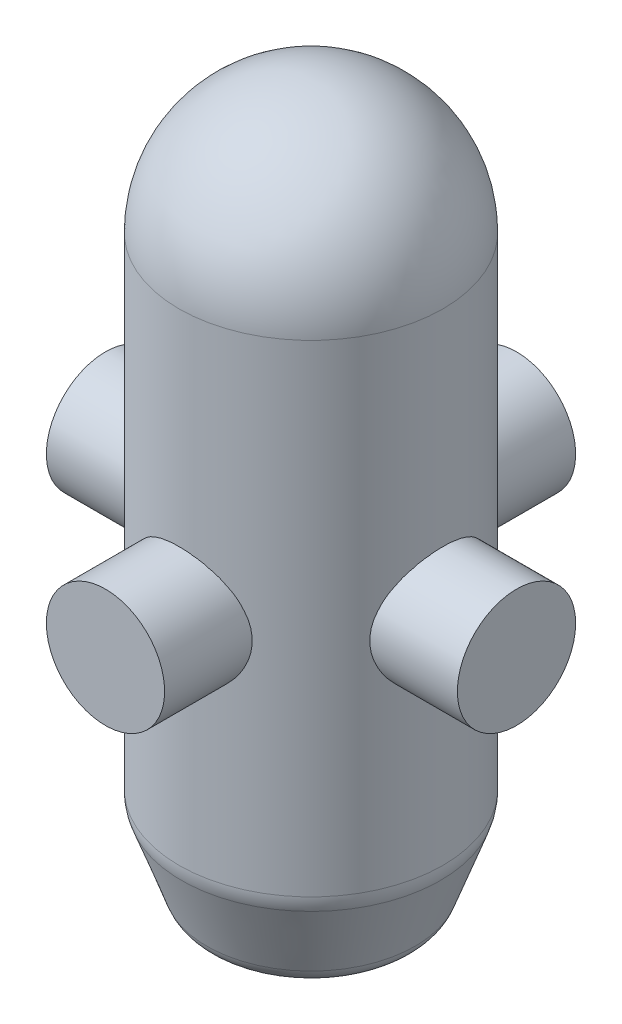
ISO-10303-21;
HEADER;
FILE_DESCRIPTION(('STEP AP214'),'2;1');
FILE_NAME('part.step','',(''),(''),'','','');
FILE_SCHEMA(('AUTOMOTIVE_DESIGN { 1 0 10303 214 1 1 1 1 }'));
ENDSEC;
DATA;
#1=APPLICATION_CONTEXT('core data for automotive mechanical design processes');
#2=APPLICATION_PROTOCOL_DEFINITION('international standard','automotive_design',2000,#1);
#3=PRODUCT_CONTEXT('',#1,'mechanical');
#4=PRODUCT('Part','Part','',(#3));
#5=PRODUCT_RELATED_PRODUCT_CATEGORY('part','',(#4));
#6=PRODUCT_DEFINITION_FORMATION('','',#4);
#7=PRODUCT_DEFINITION_CONTEXT('part definition',#1,'design');
#8=PRODUCT_DEFINITION('design','',#6,#7);
#9=PRODUCT_DEFINITION_SHAPE('','',#8);
#10=(LENGTH_UNIT() NAMED_UNIT(*) SI_UNIT(.MILLI.,.METRE.));
#11=(NAMED_UNIT(*) PLANE_ANGLE_UNIT() SI_UNIT($,.RADIAN.));
#12=(NAMED_UNIT(*) SI_UNIT($,.STERADIAN.) SOLID_ANGLE_UNIT());
#13=UNCERTAINTY_MEASURE_WITH_UNIT(LENGTH_MEASURE(1.E-05),#10,'distance_accuracy_value','');
#14=(GEOMETRIC_REPRESENTATION_CONTEXT(3) GLOBAL_UNCERTAINTY_ASSIGNED_CONTEXT((#13)) GLOBAL_UNIT_ASSIGNED_CONTEXT((#10,
#11,#12)) REPRESENTATION_CONTEXT('',''));
#15=CARTESIAN_POINT('',(0.,0.,0.));
#16=DIRECTION('',(0.,0.,1.));
#17=DIRECTION('',(1.,0.,0.));
#18=AXIS2_PLACEMENT_3D('',#15,#16,#17);
#19=CARTESIAN_POINT('',(-3.41641449005801E-13,-126.2,-97.85));
#20=DIRECTION('',(0.,0.,1.));
#21=DIRECTION('',(1.,0.,0.));
#22=AXIS2_PLACEMENT_3D('',#19,#20,#21);
#23=CYLINDRICAL_SURFACE('',#22,28.15);
#24=CARTESIAN_POINT('',(-3.41641449005801E-13,-126.2,-97.85));
#25=DIRECTION('',(0.,0.,-1.));
#26=DIRECTION('',(-1.,0.,0.));
#27=AXIS2_PLACEMENT_3D('',#24,#25,#26);
#28=CIRCLE('',#27,28.15);
#29=CARTESIAN_POINT('',(-28.1500000000003,-126.2,-97.8499999999999));
#30=VERTEX_POINT('',#29);
#31=EDGE_CURVE('E11',#30,#30,#28,.T.);
#32=ORIENTED_EDGE('',*,*,#31,.F.);
#33=EDGE_LOOP('',(#32));
#34=FACE_BOUND('',#33,.T.);
#35=CARTESIAN_POINT('',(3.41641449005801E-13,-126.2,97.85));
#36=DIRECTION('',(0.,0.,-1.));
#37=DIRECTION('',(-1.,0.,0.));
#38=AXIS2_PLACEMENT_3D('',#35,#36,#37);
#39=CIRCLE('',#38,28.15);
#40=CARTESIAN_POINT('',(-28.1499999999997,-126.2,97.8500000000001));
#41=VERTEX_POINT('',#40);
#42=EDGE_CURVE('E54',#41,#41,#39,.T.);
#43=ORIENTED_EDGE('',*,*,#42,.T.);
#44=EDGE_LOOP('',(#43));
#45=FACE_BOUND('',#44,.T.);
#46=ADVANCED_FACE('F51',(#34,#45),#23,.T.);
#47=CARTESIAN_POINT('',(-3.41641449005801E-13,-126.2,-97.85));
#48=DIRECTION('',(0.,0.,-1.));
#49=DIRECTION('',(-1.,0.,0.));
#50=AXIS2_PLACEMENT_3D('',#47,#48,#49);
#51=PLANE('',#50);
#52=ORIENTED_EDGE('',*,*,#31,.T.);
#53=EDGE_LOOP('',(#52));
#54=FACE_BOUND('',#53,.T.);
#55=ADVANCED_FACE('F66',(#54),#51,.T.);
#56=CARTESIAN_POINT('',(3.41641449005801E-13,-126.2,97.85));
#57=DIRECTION('',(0.,0.,-1.));
#58=DIRECTION('',(-1.,0.,0.));
#59=AXIS2_PLACEMENT_3D('',#56,#57,#58);
#60=PLANE('',#59);
#61=ORIENTED_EDGE('',*,*,#42,.F.);
#62=EDGE_LOOP('',(#61));
#63=FACE_BOUND('',#62,.T.);
#64=ADVANCED_FACE('F64',(#63),#60,.F.);
#65=CLOSED_SHELL('',(#46,#55,#64));
#66=MANIFOLD_SOLID_BREP('B2',#65);
#67=CARTESIAN_POINT('',(97.85,-126.2,0.));
#68=DIRECTION('',(-1.,0.,0.));
#69=DIRECTION('',(0.,0.,1.));
#70=AXIS2_PLACEMENT_3D('',#67,#68,#69);
#71=CYLINDRICAL_SURFACE('',#70,28.15);
#72=CARTESIAN_POINT('',(97.85,-126.2,0.));
#73=DIRECTION('',(1.,0.,0.));
#74=DIRECTION('',(0.,0.,-1.));
#75=AXIS2_PLACEMENT_3D('',#72,#73,#74);
#76=CIRCLE('',#75,28.15);
#77=CARTESIAN_POINT('',(97.85,-126.2,-28.15));
#78=VERTEX_POINT('',#77);
#79=EDGE_CURVE('E50',#78,#78,#76,.T.);
#80=ORIENTED_EDGE('',*,*,#79,.F.);
#81=EDGE_LOOP('',(#80));
#82=FACE_BOUND('',#81,.T.);
#83=CARTESIAN_POINT('',(-97.85,-126.2,0.));
#84=DIRECTION('',(1.,0.,0.));
#85=DIRECTION('',(0.,0.,-1.));
#86=AXIS2_PLACEMENT_3D('',#83,#84,#85);
#87=CIRCLE('',#86,28.15);
#88=CARTESIAN_POINT('',(-97.85,-126.2,-28.15));
#89=VERTEX_POINT('',#88);
#90=EDGE_CURVE('E103',#89,#89,#87,.T.);
#91=ORIENTED_EDGE('',*,*,#90,.T.);
#92=EDGE_LOOP('',(#91));
#93=FACE_BOUND('',#92,.T.);
#94=ADVANCED_FACE('F100',(#82,#93),#71,.T.);
#95=CARTESIAN_POINT('',(97.85,-126.2,0.));
#96=DIRECTION('',(1.,0.,0.));
#97=DIRECTION('',(0.,0.,-1.));
#98=AXIS2_PLACEMENT_3D('',#95,#96,#97);
#99=PLANE('',#98);
#100=ORIENTED_EDGE('',*,*,#79,.T.);
#101=EDGE_LOOP('',(#100));
#102=FACE_BOUND('',#101,.T.);
#103=ADVANCED_FACE('F115',(#102),#99,.T.);
#104=CARTESIAN_POINT('',(-97.85,-126.2,0.));
#105=DIRECTION('',(1.,0.,0.));
#106=DIRECTION('',(0.,0.,-1.));
#107=AXIS2_PLACEMENT_3D('',#104,#105,#106);
#108=PLANE('',#107);
#109=ORIENTED_EDGE('',*,*,#90,.F.);
#110=EDGE_LOOP('',(#109));
#111=FACE_BOUND('',#110,.T.);
#112=ADVANCED_FACE('F113',(#111),#108,.F.);
#113=CLOSED_SHELL('',(#94,#103,#112));
#114=MANIFOLD_SOLID_BREP('B6',#113);
#115=CARTESIAN_POINT('',(0.,-278.,0.));
#116=DIRECTION('',(0.,-1.,0.));
#117=DIRECTION('',(0.,0.,-1.));
#118=AXIS2_PLACEMENT_3D('',#115,#116,#117);
#119=CYLINDRICAL_SURFACE('',#118,62.866205);
#120=CARTESIAN_POINT('',(0.,-229.473460385831,0.));
#121=DIRECTION('',(0.,1.,0.));
#122=DIRECTION('',(0.,0.,1.));
#123=AXIS2_PLACEMENT_3D('',#120,#121,#122);
#124=CIRCLE('',#123,62.866205);
#125=CARTESIAN_POINT('',(0.,-229.473460385831,62.866205));
#126=VERTEX_POINT('',#125);
#127=EDGE_CURVE('E155',#126,#126,#124,.T.);
#128=ORIENTED_EDGE('',*,*,#127,.T.);
#129=EDGE_LOOP('',(#128));
#130=FACE_BOUND('',#129,.T.);
#131=CARTESIAN_POINT('',(0.,0.,0.));
#132=DIRECTION('',(0.,-1.,0.));
#133=DIRECTION('',(0.,0.,-1.));
#134=AXIS2_PLACEMENT_3D('',#131,#132,#133);
#135=CIRCLE('',#134,62.866205);
#136=CARTESIAN_POINT('',(0.,0.,-62.866205));
#137=VERTEX_POINT('',#136);
#138=EDGE_CURVE('E182',#137,#137,#135,.T.);
#139=ORIENTED_EDGE('',*,*,#138,.T.);
#140=EDGE_LOOP('',(#139));
#141=FACE_BOUND('',#140,.T.);
#142=ADVANCED_FACE('F143',(#130,#141),#119,.T.);
#143=CARTESIAN_POINT('',(0.,-278.,0.));
#144=DIRECTION('',(0.,1.,0.));
#145=DIRECTION('',(0.,0.,1.));
#146=AXIS2_PLACEMENT_3D('',#143,#144,#145);
#147=CONICAL_SURFACE('',#146,46.4875444580209,0.349065850398866);
#148=CARTESIAN_POINT('',(0.,-269.446261863234,0.));
#149=DIRECTION('',(0.,-1.,0.));
#150=DIRECTION('',(0.,0.,-1.));
#151=AXIS2_PLACEMENT_3D('',#148,#149,#150);
#152=CIRCLE('',#151,49.6008505315115);
#153=CARTESIAN_POINT('',(0.,-269.446261863234,-49.6008505315115));
#154=VERTEX_POINT('',#153);
#155=EDGE_CURVE('E99',#154,#154,#152,.F.);
#156=ORIENTED_EDGE('',*,*,#155,.T.);
#157=EDGE_LOOP('',(#156));
#158=FACE_BOUND('',#157,.T.);
#159=CARTESIAN_POINT('',(0.,-236.313863252344,0.));
#160=DIRECTION('',(0.,-1.,0.));
#161=DIRECTION('',(0.,0.,-1.));
#162=AXIS2_PLACEMENT_3D('',#159,#160,#161);
#163=CIRCLE('',#162,61.6600574157182);
#164=CARTESIAN_POINT('',(0.,-236.313863252344,-61.6600574157182));
#165=VERTEX_POINT('',#164);
#166=EDGE_CURVE('E159',#165,#165,#163,.T.);
#167=ORIENTED_EDGE('',*,*,#166,.T.);
#168=EDGE_LOOP('',(#167));
#169=FACE_BOUND('',#168,.T.);
#170=ADVANCED_FACE('F199',(#158,#169),#147,.T.);
#171=CARTESIAN_POINT('',(46.4875444580209,-278.,0.));
#172=DIRECTION('',(0.,-1.,0.));
#173=DIRECTION('',(0.,0.,-1.));
#174=AXIS2_PLACEMENT_3D('',#171,#172,#173);
#175=PLANE('',#174);
#176=CARTESIAN_POINT('',(0.,-278.,0.));
#177=DIRECTION('',(0.,-1.,0.));
#178=DIRECTION('',(0.,0.,-1.));
#179=AXIS2_PLACEMENT_3D('',#176,#177,#178);
#180=CIRCLE('',#179,37.3848464612947);
#181=CARTESIAN_POINT('',(0.,-278.,-37.3848464612947));
#182=VERTEX_POINT('',#181);
#183=EDGE_CURVE('E151',#182,#182,#180,.T.);
#184=ORIENTED_EDGE('',*,*,#183,.T.);
#185=EDGE_LOOP('',(#184));
#186=FACE_BOUND('',#185,.T.);
#187=ADVANCED_FACE('F205',(#186),#175,.T.);
#188=CARTESIAN_POINT('',(0.,-229.473460385831,0.));
#189=DIRECTION('',(0.,1.,0.));
#190=DIRECTION('',(0.,0.,1.));
#191=AXIS2_PLACEMENT_3D('',#188,#189,#190);
#192=TOROIDAL_SURFACE('',#191,42.866205,20.);
#193=ORIENTED_EDGE('',*,*,#127,.F.);
#194=EDGE_LOOP('',(#193));
#195=FACE_BOUND('',#194,.T.);
#196=ORIENTED_EDGE('',*,*,#166,.F.);
#197=EDGE_LOOP('',(#196));
#198=FACE_BOUND('',#197,.T.);
#199=ADVANCED_FACE('F194',(#195,#198),#192,.T.);
#200=CARTESIAN_POINT('',(0.,-265.,0.));
#201=DIRECTION('',(0.,-1.,0.));
#202=DIRECTION('',(0.,0.,-1.));
#203=AXIS2_PLACEMENT_3D('',#200,#201,#202);
#204=TOROIDAL_SURFACE('',#203,37.3848464612947,13.);
#205=ORIENTED_EDGE('',*,*,#155,.F.);
#206=EDGE_LOOP('',(#205));
#207=FACE_BOUND('',#206,.T.);
#208=ORIENTED_EDGE('',*,*,#183,.F.);
#209=EDGE_LOOP('',(#208));
#210=FACE_BOUND('',#209,.T.);
#211=ADVANCED_FACE('F145',(#207,#210),#204,.T.);
#212=CARTESIAN_POINT('',(0.,0.,0.));
#213=DIRECTION('',(0.,-1.,0.));
#214=DIRECTION('',(0.,0.,-1.));
#215=AXIS2_PLACEMENT_3D('',#212,#213,#214);
#216=SPHERICAL_SURFACE('',#215,62.866205);
#217=ORIENTED_EDGE('',*,*,#138,.F.);
#218=EDGE_LOOP('',(#217));
#219=FACE_BOUND('',#218,.T.);
#220=ADVANCED_FACE('F187',(#219),#216,.T.);
#221=CLOSED_SHELL('',(#142,#170,#187,#199,#211,#220));
#222=CARTESIAN_POINT('',(0.,0.,62.866205));
#223=DIRECTION('',(0.,1.,0.));
#224=DIRECTION('',(0.,0.,1.));
#225=AXIS2_PLACEMENT_3D('',#222,#223,#224);
#226=PLANE('',#225);
#227=CARTESIAN_POINT('',(0.,0.,0.));
#228=DIRECTION('',(0.,1.,0.));
#229=DIRECTION('',(0.,0.,1.));
#230=AXIS2_PLACEMENT_3D('',#227,#228,#229);
#231=CIRCLE('',#230,57.866205);
#232=CARTESIAN_POINT('',(0.,0.,57.866205));
#233=VERTEX_POINT('',#232);
#234=EDGE_CURVE('E165',#233,#233,#231,.F.);
#235=ORIENTED_EDGE('',*,*,#234,.T.);
#236=EDGE_LOOP('',(#235));
#237=FACE_BOUND('',#236,.T.);
#238=ADVANCED_FACE('F234',(#237),#226,.F.);
#239=CARTESIAN_POINT('',(46.4875444580209,-273.,0.));
#240=DIRECTION('',(0.,-1.,0.));
#241=DIRECTION('',(0.,0.,-1.));
#242=AXIS2_PLACEMENT_3D('',#239,#240,#241);
#243=PLANE('',#242);
#244=CARTESIAN_POINT('',(0.,-273.,0.));
#245=DIRECTION('',(0.,-1.,0.));
#246=DIRECTION('',(0.,0.,-1.));
#247=AXIS2_PLACEMENT_3D('',#244,#245,#246);
#248=CIRCLE('',#247,37.3848464612947);
#249=CARTESIAN_POINT('',(0.,-273.,-37.3848464612947));
#250=VERTEX_POINT('',#249);
#251=EDGE_CURVE('E170',#250,#250,#248,.T.);
#252=ORIENTED_EDGE('',*,*,#251,.F.);
#253=EDGE_LOOP('',(#252));
#254=FACE_BOUND('',#253,.T.);
#255=ADVANCED_FACE('F224',(#254),#243,.F.);
#256=CARTESIAN_POINT('',(0.,-265.,0.));
#257=DIRECTION('',(0.,-1.,0.));
#258=DIRECTION('',(0.,0.,-1.));
#259=AXIS2_PLACEMENT_3D('',#256,#257,#258);
#260=TOROIDAL_SURFACE('',#259,37.3848464612947,8.);
#261=CARTESIAN_POINT('',(0.,-267.736161146605,0.));
#262=DIRECTION('',(0.,1.,0.));
#263=DIRECTION('',(0.,0.,1.));
#264=AXIS2_PLACEMENT_3D('',#261,#262,#263);
#265=CIRCLE('',#264,44.9023874275819);
#266=CARTESIAN_POINT('',(0.,-267.736161146605,44.9023874275819));
#267=VERTEX_POINT('',#266);
#268=EDGE_CURVE('E164',#267,#267,#265,.T.);
#269=ORIENTED_EDGE('',*,*,#268,.T.);
#270=EDGE_LOOP('',(#269));
#271=FACE_BOUND('',#270,.T.);
#272=ORIENTED_EDGE('',*,*,#251,.T.);
#273=EDGE_LOOP('',(#272));
#274=FACE_BOUND('',#273,.T.);
#275=ADVANCED_FACE('F220',(#271,#274),#260,.F.);
#276=CARTESIAN_POINT('',(0.,-276.289899283372,0.));
#277=DIRECTION('',(0.,1.,0.));
#278=DIRECTION('',(0.,0.,1.));
#279=AXIS2_PLACEMENT_3D('',#276,#277,#278);
#280=CONICAL_SURFACE('',#279,41.7890813540914,0.349065850398866);
#281=ORIENTED_EDGE('',*,*,#268,.F.);
#282=EDGE_LOOP('',(#281));
#283=FACE_BOUND('',#282,.T.);
#284=CARTESIAN_POINT('',(0.,-234.603762535716,0.));
#285=DIRECTION('',(0.,1.,0.));
#286=DIRECTION('',(0.,0.,1.));
#287=AXIS2_PLACEMENT_3D('',#284,#285,#286);
#288=CIRCLE('',#287,56.9615943117886);
#289=CARTESIAN_POINT('',(0.,-234.603762535716,56.9615943117886));
#290=VERTEX_POINT('',#289);
#291=EDGE_CURVE('E168',#290,#290,#288,.F.);
#292=ORIENTED_EDGE('',*,*,#291,.F.);
#293=EDGE_LOOP('',(#292));
#294=FACE_BOUND('',#293,.T.);
#295=ADVANCED_FACE('F223',(#283,#294),#280,.F.);
#296=CARTESIAN_POINT('',(0.,-229.473460385831,0.));
#297=DIRECTION('',(0.,1.,0.));
#298=DIRECTION('',(0.,0.,1.));
#299=AXIS2_PLACEMENT_3D('',#296,#297,#298);
#300=TOROIDAL_SURFACE('',#299,42.866205,15.);
#301=CARTESIAN_POINT('',(0.,-229.473460385831,0.));
#302=DIRECTION('',(0.,-1.,0.));
#303=DIRECTION('',(0.,0.,-1.));
#304=AXIS2_PLACEMENT_3D('',#301,#302,#303);
#305=CIRCLE('',#304,57.866205);
#306=CARTESIAN_POINT('',(0.,-229.473460385831,-57.866205));
#307=VERTEX_POINT('',#306);
#308=EDGE_CURVE('E173',#307,#307,#305,.F.);
#309=ORIENTED_EDGE('',*,*,#308,.T.);
#310=EDGE_LOOP('',(#309));
#311=FACE_BOUND('',#310,.T.);
#312=ORIENTED_EDGE('',*,*,#291,.T.);
#313=EDGE_LOOP('',(#312));
#314=FACE_BOUND('',#313,.T.);
#315=ADVANCED_FACE('F227',(#311,#314),#300,.F.);
#316=CARTESIAN_POINT('',(0.,-278.,0.));
#317=DIRECTION('',(0.,-1.,0.));
#318=DIRECTION('',(0.,0.,-1.));
#319=AXIS2_PLACEMENT_3D('',#316,#317,#318);
#320=CYLINDRICAL_SURFACE('',#319,57.866205);
#321=ORIENTED_EDGE('',*,*,#308,.F.);
#322=EDGE_LOOP('',(#321));
#323=FACE_BOUND('',#322,.T.);
#324=ORIENTED_EDGE('',*,*,#234,.F.);
#325=EDGE_LOOP('',(#324));
#326=FACE_BOUND('',#325,.T.);
#327=ADVANCED_FACE('F230',(#323,#326),#320,.F.);
#328=CLOSED_SHELL('',(#238,#255,#275,#295,#315,#327));
#329=CARTESIAN_POINT('',(0.,0.,0.));
#330=DIRECTION('',(0.,-1.,0.));
#331=DIRECTION('',(0.,0.,-1.));
#332=AXIS2_PLACEMENT_3D('',#329,#330,#331);
#333=SPHERICAL_SURFACE('',#332,57.866205);
#334=CARTESIAN_POINT('',(0.,5.,0.));
#335=DIRECTION('',(0.,1.,0.));
#336=DIRECTION('',(0.,0.,1.));
#337=AXIS2_PLACEMENT_3D('',#334,#335,#336);
#338=CIRCLE('',#337,57.6497847446287);
#339=CARTESIAN_POINT('',(0.,5.,57.6497847446287));
#340=VERTEX_POINT('',#339);
#341=EDGE_CURVE('E169',#340,#340,#338,.F.);
#342=ORIENTED_EDGE('',*,*,#341,.T.);
#343=EDGE_LOOP('',(#342));
#344=FACE_BOUND('',#343,.T.);
#345=ADVANCED_FACE('F244',(#344),#333,.F.);
#346=CARTESIAN_POINT('',(0.,5.,62.866205));
#347=DIRECTION('',(0.,1.,0.));
#348=DIRECTION('',(0.,0.,1.));
#349=AXIS2_PLACEMENT_3D('',#346,#347,#348);
#350=PLANE('',#349);
#351=ORIENTED_EDGE('',*,*,#341,.F.);
#352=EDGE_LOOP('',(#351));
#353=FACE_BOUND('',#352,.T.);
#354=ADVANCED_FACE('F242',(#353),#350,.T.);
#355=CLOSED_SHELL('',(#345,#354));
#356=ORIENTED_CLOSED_SHELL('',*,#328,.T.);
#357=ORIENTED_CLOSED_SHELL('',*,#355,.T.);
#358=BREP_WITH_VOIDS('B45',#221,(#356,#357));
#359=ADVANCED_BREP_SHAPE_REPRESENTATION('',(#18,#66,#114,#358),#14);
#360=SHAPE_DEFINITION_REPRESENTATION(#9,#359);
ENDSEC;
END-ISO-10303-21;
